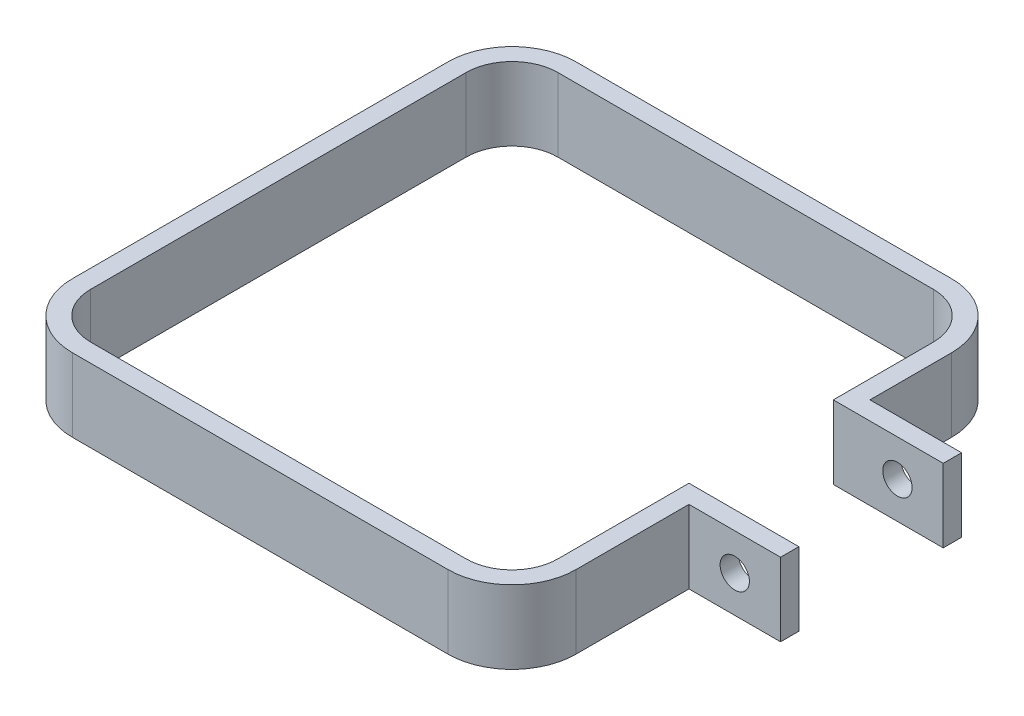
ISO-10303-21;
HEADER;
FILE_DESCRIPTION(('STEP AP214'),'2;1');
FILE_NAME('part.step','',(''),(''),'','','');
FILE_SCHEMA(('AUTOMOTIVE_DESIGN { 1 0 10303 214 1 1 1 1 }'));
ENDSEC;
DATA;
#1=APPLICATION_CONTEXT('core data for automotive mechanical design processes');
#2=APPLICATION_PROTOCOL_DEFINITION('international standard','automotive_design',2000,#1);
#3=PRODUCT_CONTEXT('',#1,'mechanical');
#4=PRODUCT('Part','Part','',(#3));
#5=PRODUCT_RELATED_PRODUCT_CATEGORY('part','',(#4));
#6=PRODUCT_DEFINITION_FORMATION('','',#4);
#7=PRODUCT_DEFINITION_CONTEXT('part definition',#1,'design');
#8=PRODUCT_DEFINITION('design','',#6,#7);
#9=PRODUCT_DEFINITION_SHAPE('','',#8);
#10=(LENGTH_UNIT() NAMED_UNIT(*) SI_UNIT(.MILLI.,.METRE.));
#11=(NAMED_UNIT(*) PLANE_ANGLE_UNIT() SI_UNIT($,.RADIAN.));
#12=(NAMED_UNIT(*) SI_UNIT($,.STERADIAN.) SOLID_ANGLE_UNIT());
#13=UNCERTAINTY_MEASURE_WITH_UNIT(LENGTH_MEASURE(1.E-05),#10,'distance_accuracy_value','');
#14=(GEOMETRIC_REPRESENTATION_CONTEXT(3) GLOBAL_UNCERTAINTY_ASSIGNED_CONTEXT((#13)) GLOBAL_UNIT_ASSIGNED_CONTEXT((#10,
#11,#12)) REPRESENTATION_CONTEXT('',''));
#15=CARTESIAN_POINT('',(0.,0.,0.));
#16=DIRECTION('',(0.,0.,1.));
#17=DIRECTION('',(1.,0.,0.));
#18=AXIS2_PLACEMENT_3D('',#15,#16,#17);
#19=CARTESIAN_POINT('',(20.5,8.,20.5));
#20=DIRECTION('',(0.,-1.,0.));
#21=DIRECTION('',(0.,0.,-1.));
#22=AXIS2_PLACEMENT_3D('',#19,#20,#21);
#23=CYLINDRICAL_SURFACE('',#22,5.);
#24=CARTESIAN_POINT('',(20.5,0.,20.5));
#25=DIRECTION('',(0.,-1.,0.));
#26=DIRECTION('',(0.,0.,1.));
#27=AXIS2_PLACEMENT_3D('',#24,#25,#26);
#28=CIRCLE('',#27,5.);
#29=CARTESIAN_POINT('',(25.5,0.,20.5));
#30=VERTEX_POINT('',#29);
#31=CARTESIAN_POINT('',(20.5,0.,25.5));
#32=VERTEX_POINT('',#31);
#33=EDGE_CURVE('E237',#30,#32,#28,.T.);
#34=ORIENTED_EDGE('',*,*,#33,.T.);
#35=DIRECTION('',(0.,-1.,0.));
#36=VECTOR('',#35,1.);
#37=CARTESIAN_POINT('',(20.5,8.,25.5));
#38=LINE('',#37,#36);
#39=CARTESIAN_POINT('',(20.5,8.,25.5));
#40=VERTEX_POINT('',#39);
#41=EDGE_CURVE('E11',#40,#32,#38,.T.);
#42=ORIENTED_EDGE('',*,*,#41,.F.);
#43=CARTESIAN_POINT('',(20.5,8.,20.5));
#44=DIRECTION('',(0.,-1.,0.));
#45=DIRECTION('',(0.,0.,1.));
#46=AXIS2_PLACEMENT_3D('',#43,#44,#45);
#47=CIRCLE('',#46,5.);
#48=CARTESIAN_POINT('',(25.5,8.,20.5));
#49=VERTEX_POINT('',#48);
#50=EDGE_CURVE('E309',#49,#40,#47,.T.);
#51=ORIENTED_EDGE('',*,*,#50,.F.);
#52=DIRECTION('',(0.,-1.,0.));
#53=VECTOR('',#52,1.);
#54=CARTESIAN_POINT('',(25.5,8.,20.5));
#55=LINE('',#54,#53);
#56=EDGE_CURVE('E233',#49,#30,#55,.T.);
#57=ORIENTED_EDGE('',*,*,#56,.T.);
#58=EDGE_LOOP('',(#34,#42,#51,#57));
#59=FACE_BOUND('',#58,.T.);
#60=ADVANCED_FACE('F39',(#59),#23,.F.);
#61=CARTESIAN_POINT('',(-20.5,8.,25.5));
#62=DIRECTION('',(0.,0.,1.));
#63=DIRECTION('',(1.,0.,0.));
#64=AXIS2_PLACEMENT_3D('',#61,#62,#63);
#65=PLANE('',#64);
#66=DIRECTION('',(-1.,0.,0.));
#67=VECTOR('',#66,1.);
#68=CARTESIAN_POINT('',(-20.5,0.,25.5));
#69=LINE('',#68,#67);
#70=CARTESIAN_POINT('',(-20.5,0.,25.5));
#71=VERTEX_POINT('',#70);
#72=EDGE_CURVE('E241',#32,#71,#69,.T.);
#73=ORIENTED_EDGE('',*,*,#72,.T.);
#74=DIRECTION('',(0.,-1.,0.));
#75=VECTOR('',#74,1.);
#76=CARTESIAN_POINT('',(-20.5,8.,25.5));
#77=LINE('',#76,#75);
#78=CARTESIAN_POINT('',(-20.5,8.,25.5));
#79=VERTEX_POINT('',#78);
#80=EDGE_CURVE('E49',#79,#71,#77,.T.);
#81=ORIENTED_EDGE('',*,*,#80,.F.);
#82=DIRECTION('',(-1.,0.,0.));
#83=VECTOR('',#82,1.);
#84=CARTESIAN_POINT('',(-20.5,8.,25.5));
#85=LINE('',#84,#83);
#86=EDGE_CURVE('E147',#40,#79,#85,.T.);
#87=ORIENTED_EDGE('',*,*,#86,.F.);
#88=ORIENTED_EDGE('',*,*,#41,.T.);
#89=EDGE_LOOP('',(#73,#81,#87,#88));
#90=FACE_BOUND('',#89,.T.);
#91=ADVANCED_FACE('F489',(#90),#65,.F.);
#92=CARTESIAN_POINT('',(-20.5,8.,20.5));
#93=DIRECTION('',(0.,-1.,0.));
#94=DIRECTION('',(0.,0.,-1.));
#95=AXIS2_PLACEMENT_3D('',#92,#93,#94);
#96=CYLINDRICAL_SURFACE('',#95,5.);
#97=CARTESIAN_POINT('',(-20.5,0.,20.5));
#98=DIRECTION('',(0.,-1.,0.));
#99=DIRECTION('',(0.,0.,-1.));
#100=AXIS2_PLACEMENT_3D('',#97,#98,#99);
#101=CIRCLE('',#100,5.);
#102=CARTESIAN_POINT('',(-25.5,0.,20.5));
#103=VERTEX_POINT('',#102);
#104=EDGE_CURVE('E245',#71,#103,#101,.T.);
#105=ORIENTED_EDGE('',*,*,#104,.T.);
#106=DIRECTION('',(0.,-1.,0.));
#107=VECTOR('',#106,1.);
#108=CARTESIAN_POINT('',(-25.5,8.,20.5));
#109=LINE('',#108,#107);
#110=CARTESIAN_POINT('',(-25.5,8.,20.5));
#111=VERTEX_POINT('',#110);
#112=EDGE_CURVE('E384',#111,#103,#109,.T.);
#113=ORIENTED_EDGE('',*,*,#112,.F.);
#114=CARTESIAN_POINT('',(-20.5,8.,20.5));
#115=DIRECTION('',(0.,-1.,0.));
#116=DIRECTION('',(0.,0.,-1.));
#117=AXIS2_PLACEMENT_3D('',#114,#115,#116);
#118=CIRCLE('',#117,5.);
#119=EDGE_CURVE('E395',#79,#111,#118,.T.);
#120=ORIENTED_EDGE('',*,*,#119,.F.);
#121=ORIENTED_EDGE('',*,*,#80,.T.);
#122=EDGE_LOOP('',(#105,#113,#120,#121));
#123=FACE_BOUND('',#122,.T.);
#124=ADVANCED_FACE('F393',(#123),#96,.F.);
#125=CARTESIAN_POINT('',(-25.5,8.,-20.5));
#126=DIRECTION('',(-1.,0.,0.));
#127=DIRECTION('',(0.,0.,1.));
#128=AXIS2_PLACEMENT_3D('',#125,#126,#127);
#129=PLANE('',#128);
#130=DIRECTION('',(0.,0.,-1.));
#131=VECTOR('',#130,1.);
#132=CARTESIAN_POINT('',(-25.5,0.,-20.5));
#133=LINE('',#132,#131);
#134=CARTESIAN_POINT('',(-25.5,0.,-20.5));
#135=VERTEX_POINT('',#134);
#136=EDGE_CURVE('E248',#103,#135,#133,.T.);
#137=ORIENTED_EDGE('',*,*,#136,.T.);
#138=DIRECTION('',(0.,-1.,0.));
#139=VECTOR('',#138,1.);
#140=CARTESIAN_POINT('',(-25.5,8.,-20.5));
#141=LINE('',#140,#139);
#142=CARTESIAN_POINT('',(-25.5,8.,-20.5));
#143=VERTEX_POINT('',#142);
#144=EDGE_CURVE('E380',#143,#135,#141,.T.);
#145=ORIENTED_EDGE('',*,*,#144,.F.);
#146=DIRECTION('',(0.,0.,-1.));
#147=VECTOR('',#146,1.);
#148=CARTESIAN_POINT('',(-25.5,8.,-20.5));
#149=LINE('',#148,#147);
#150=EDGE_CURVE('E414',#111,#143,#149,.T.);
#151=ORIENTED_EDGE('',*,*,#150,.F.);
#152=ORIENTED_EDGE('',*,*,#112,.T.);
#153=EDGE_LOOP('',(#137,#145,#151,#152));
#154=FACE_BOUND('',#153,.T.);
#155=ADVANCED_FACE('F404',(#154),#129,.F.);
#156=CARTESIAN_POINT('',(-20.5,8.,-20.5));
#157=DIRECTION('',(0.,-1.,0.));
#158=DIRECTION('',(0.,0.,-1.));
#159=AXIS2_PLACEMENT_3D('',#156,#157,#158);
#160=CYLINDRICAL_SURFACE('',#159,5.);
#161=CARTESIAN_POINT('',(-20.5,0.,-20.5));
#162=DIRECTION('',(0.,-1.,0.));
#163=DIRECTION('',(0.,0.,1.));
#164=AXIS2_PLACEMENT_3D('',#161,#162,#163);
#165=CIRCLE('',#164,5.);
#166=CARTESIAN_POINT('',(-20.5,0.,-25.5));
#167=VERTEX_POINT('',#166);
#168=EDGE_CURVE('E251',#135,#167,#165,.T.);
#169=ORIENTED_EDGE('',*,*,#168,.T.);
#170=DIRECTION('',(0.,-1.,0.));
#171=VECTOR('',#170,1.);
#172=CARTESIAN_POINT('',(-20.5,8.,-25.5));
#173=LINE('',#172,#171);
#174=CARTESIAN_POINT('',(-20.5,8.,-25.5));
#175=VERTEX_POINT('',#174);
#176=EDGE_CURVE('E376',#175,#167,#173,.T.);
#177=ORIENTED_EDGE('',*,*,#176,.F.);
#178=CARTESIAN_POINT('',(-20.5,8.,-20.5));
#179=DIRECTION('',(0.,-1.,0.));
#180=DIRECTION('',(0.,0.,1.));
#181=AXIS2_PLACEMENT_3D('',#178,#179,#180);
#182=CIRCLE('',#181,5.);
#183=EDGE_CURVE('E410',#143,#175,#182,.T.);
#184=ORIENTED_EDGE('',*,*,#183,.F.);
#185=ORIENTED_EDGE('',*,*,#144,.T.);
#186=EDGE_LOOP('',(#169,#177,#184,#185));
#187=FACE_BOUND('',#186,.T.);
#188=ADVANCED_FACE('F408',(#187),#160,.F.);
#189=CARTESIAN_POINT('',(-20.5,8.,-25.5));
#190=DIRECTION('',(0.,0.,-1.));
#191=DIRECTION('',(-1.,0.,0.));
#192=AXIS2_PLACEMENT_3D('',#189,#190,#191);
#193=PLANE('',#192);
#194=DIRECTION('',(1.,0.,0.));
#195=VECTOR('',#194,1.);
#196=CARTESIAN_POINT('',(-20.5,0.,-25.5));
#197=LINE('',#196,#195);
#198=CARTESIAN_POINT('',(20.5,0.,-25.5));
#199=VERTEX_POINT('',#198);
#200=EDGE_CURVE('E254',#167,#199,#197,.T.);
#201=ORIENTED_EDGE('',*,*,#200,.T.);
#202=DIRECTION('',(0.,-1.,0.));
#203=VECTOR('',#202,1.);
#204=CARTESIAN_POINT('',(20.5,8.,-25.5));
#205=LINE('',#204,#203);
#206=CARTESIAN_POINT('',(20.5,8.,-25.5));
#207=VERTEX_POINT('',#206);
#208=EDGE_CURVE('E372',#207,#199,#205,.T.);
#209=ORIENTED_EDGE('',*,*,#208,.F.);
#210=DIRECTION('',(1.,0.,0.));
#211=VECTOR('',#210,1.);
#212=CARTESIAN_POINT('',(-20.5,8.,-25.5));
#213=LINE('',#212,#211);
#214=EDGE_CURVE('E413',#175,#207,#213,.T.);
#215=ORIENTED_EDGE('',*,*,#214,.F.);
#216=ORIENTED_EDGE('',*,*,#176,.T.);
#217=EDGE_LOOP('',(#201,#209,#215,#216));
#218=FACE_BOUND('',#217,.T.);
#219=ADVANCED_FACE('F502',(#218),#193,.F.);
#220=CARTESIAN_POINT('',(20.5,8.,-20.5));
#221=DIRECTION('',(0.,-1.,0.));
#222=DIRECTION('',(0.,0.,-1.));
#223=AXIS2_PLACEMENT_3D('',#220,#221,#222);
#224=CYLINDRICAL_SURFACE('',#223,5.);
#225=CARTESIAN_POINT('',(20.5,0.,-20.5));
#226=DIRECTION('',(0.,-1.,0.));
#227=DIRECTION('',(0.,0.,1.));
#228=AXIS2_PLACEMENT_3D('',#225,#226,#227);
#229=CIRCLE('',#228,5.);
#230=CARTESIAN_POINT('',(25.5,0.,-20.5));
#231=VERTEX_POINT('',#230);
#232=EDGE_CURVE('E257',#199,#231,#229,.T.);
#233=ORIENTED_EDGE('',*,*,#232,.T.);
#234=DIRECTION('',(0.,-1.,0.));
#235=VECTOR('',#234,1.);
#236=CARTESIAN_POINT('',(25.5,8.,-20.5));
#237=LINE('',#236,#235);
#238=CARTESIAN_POINT('',(25.5,8.,-20.5));
#239=VERTEX_POINT('',#238);
#240=EDGE_CURVE('E368',#239,#231,#237,.T.);
#241=ORIENTED_EDGE('',*,*,#240,.F.);
#242=CARTESIAN_POINT('',(20.5,8.,-20.5));
#243=DIRECTION('',(0.,-1.,0.));
#244=DIRECTION('',(0.,0.,1.));
#245=AXIS2_PLACEMENT_3D('',#242,#243,#244);
#246=CIRCLE('',#245,5.);
#247=EDGE_CURVE('E418',#207,#239,#246,.T.);
#248=ORIENTED_EDGE('',*,*,#247,.F.);
#249=ORIENTED_EDGE('',*,*,#208,.T.);
#250=EDGE_LOOP('',(#233,#241,#248,#249));
#251=FACE_BOUND('',#250,.T.);
#252=ADVANCED_FACE('F505',(#251),#224,.F.);
#253=CARTESIAN_POINT('',(25.5,8.,-20.5));
#254=DIRECTION('',(1.,0.,0.));
#255=DIRECTION('',(0.,0.,-1.));
#256=AXIS2_PLACEMENT_3D('',#253,#254,#255);
#257=PLANE('',#256);
#258=DIRECTION('',(0.,0.,1.));
#259=VECTOR('',#258,1.);
#260=CARTESIAN_POINT('',(25.5,0.,-20.5));
#261=LINE('',#260,#259);
#262=CARTESIAN_POINT('',(25.5,0.,-9.5841835));
#263=VERTEX_POINT('',#262);
#264=EDGE_CURVE('E260',#231,#263,#261,.T.);
#265=ORIENTED_EDGE('',*,*,#264,.T.);
#266=DIRECTION('',(0.,-1.,0.));
#267=VECTOR('',#266,1.);
#268=CARTESIAN_POINT('',(25.5,8.,-9.5841835));
#269=LINE('',#268,#267);
#270=CARTESIAN_POINT('',(25.5,8.,-9.5841835));
#271=VERTEX_POINT('',#270);
#272=EDGE_CURVE('E364',#271,#263,#269,.T.);
#273=ORIENTED_EDGE('',*,*,#272,.F.);
#274=DIRECTION('',(0.,0.,1.));
#275=VECTOR('',#274,1.);
#276=CARTESIAN_POINT('',(25.5,8.,-20.5));
#277=LINE('',#276,#275);
#278=EDGE_CURVE('E425',#239,#271,#277,.T.);
#279=ORIENTED_EDGE('',*,*,#278,.F.);
#280=ORIENTED_EDGE('',*,*,#240,.T.);
#281=EDGE_LOOP('',(#265,#273,#279,#280));
#282=FACE_BOUND('',#281,.T.);
#283=ADVANCED_FACE('F509',(#282),#257,.F.);
#284=CARTESIAN_POINT('',(37.5,8.,-9.5841835));
#285=DIRECTION('',(0.,0.,-1.));
#286=DIRECTION('',(-1.,0.,0.));
#287=AXIS2_PLACEMENT_3D('',#284,#285,#286);
#288=PLANE('',#287);
#289=CARTESIAN_POINT('',(32.5,4.,-9.5841835));
#290=DIRECTION('',(0.,0.,-1.));
#291=DIRECTION('',(-1.,0.,0.));
#292=AXIS2_PLACEMENT_3D('',#289,#290,#291);
#293=CIRCLE('',#292,1.6);
#294=CARTESIAN_POINT('',(30.9,4.,-9.5841835));
#295=VERTEX_POINT('',#294);
#296=EDGE_CURVE('E242',#295,#295,#293,.T.);
#297=ORIENTED_EDGE('',*,*,#296,.T.);
#298=EDGE_LOOP('',(#297));
#299=FACE_BOUND('',#298,.T.);
#300=DIRECTION('',(1.,0.,0.));
#301=VECTOR('',#300,1.);
#302=CARTESIAN_POINT('',(37.5,0.,-9.5841835));
#303=LINE('',#302,#301);
#304=CARTESIAN_POINT('',(37.5,0.,-9.5841835));
#305=VERTEX_POINT('',#304);
#306=EDGE_CURVE('E264',#263,#305,#303,.T.);
#307=ORIENTED_EDGE('',*,*,#306,.T.);
#308=DIRECTION('',(0.,-1.,0.));
#309=VECTOR('',#308,1.);
#310=CARTESIAN_POINT('',(37.5,8.,-9.5841835));
#311=LINE('',#310,#309);
#312=CARTESIAN_POINT('',(37.5,8.,-9.5841835));
#313=VERTEX_POINT('',#312);
#314=EDGE_CURVE('E360',#313,#305,#311,.T.);
#315=ORIENTED_EDGE('',*,*,#314,.F.);
#316=DIRECTION('',(1.,0.,0.));
#317=VECTOR('',#316,1.);
#318=CARTESIAN_POINT('',(27.5,8.,-9.5841835));
#319=LINE('',#318,#317);
#320=EDGE_CURVE('E428',#271,#313,#319,.T.);
#321=ORIENTED_EDGE('',*,*,#320,.F.);
#322=ORIENTED_EDGE('',*,*,#272,.T.);
#323=EDGE_LOOP('',(#307,#315,#321,#322));
#324=FACE_BOUND('',#323,.T.);
#325=ADVANCED_FACE('F513',(#299,#324),#288,.F.);
#326=CARTESIAN_POINT('',(37.5,8.,-11.5841835));
#327=DIRECTION('',(-1.,0.,0.));
#328=DIRECTION('',(0.,0.,1.));
#329=AXIS2_PLACEMENT_3D('',#326,#327,#328);
#330=PLANE('',#329);
#331=DIRECTION('',(0.,0.,-1.));
#332=VECTOR('',#331,1.);
#333=CARTESIAN_POINT('',(37.5,0.,-11.5841835));
#334=LINE('',#333,#332);
#335=CARTESIAN_POINT('',(37.5,0.,-11.5841835));
#336=VERTEX_POINT('',#335);
#337=EDGE_CURVE('E267',#305,#336,#334,.T.);
#338=ORIENTED_EDGE('',*,*,#337,.T.);
#339=DIRECTION('',(0.,-1.,0.));
#340=VECTOR('',#339,1.);
#341=CARTESIAN_POINT('',(37.5,8.,-11.5841835));
#342=LINE('',#341,#340);
#343=CARTESIAN_POINT('',(37.5,8.,-11.5841835));
#344=VERTEX_POINT('',#343);
#345=EDGE_CURVE('E356',#344,#336,#342,.T.);
#346=ORIENTED_EDGE('',*,*,#345,.F.);
#347=DIRECTION('',(0.,0.,-1.));
#348=VECTOR('',#347,1.);
#349=CARTESIAN_POINT('',(37.5,8.,-11.5841835));
#350=LINE('',#349,#348);
#351=EDGE_CURVE('E431',#313,#344,#350,.T.);
#352=ORIENTED_EDGE('',*,*,#351,.F.);
#353=ORIENTED_EDGE('',*,*,#314,.T.);
#354=EDGE_LOOP('',(#338,#346,#352,#353));
#355=FACE_BOUND('',#354,.T.);
#356=ADVANCED_FACE('F517',(#355),#330,.F.);
#357=CARTESIAN_POINT('',(27.5,8.,-11.5841835));
#358=DIRECTION('',(0.,0.,1.));
#359=DIRECTION('',(1.,0.,0.));
#360=AXIS2_PLACEMENT_3D('',#357,#358,#359);
#361=PLANE('',#360);
#362=CARTESIAN_POINT('',(32.5,4.,-11.5841835));
#363=DIRECTION('',(0.,0.,-1.));
#364=DIRECTION('',(-1.,0.,0.));
#365=AXIS2_PLACEMENT_3D('',#362,#363,#364);
#366=CIRCLE('',#365,1.6);
#367=CARTESIAN_POINT('',(30.9,4.,-11.5841835));
#368=VERTEX_POINT('',#367);
#369=EDGE_CURVE('E743',#368,#368,#366,.T.);
#370=ORIENTED_EDGE('',*,*,#369,.F.);
#371=EDGE_LOOP('',(#370));
#372=FACE_BOUND('',#371,.T.);
#373=DIRECTION('',(-1.,0.,0.));
#374=VECTOR('',#373,1.);
#375=CARTESIAN_POINT('',(27.5,0.,-11.5841835));
#376=LINE('',#375,#374);
#377=CARTESIAN_POINT('',(27.5,0.,-11.5841835));
#378=VERTEX_POINT('',#377);
#379=EDGE_CURVE('E270',#336,#378,#376,.T.);
#380=ORIENTED_EDGE('',*,*,#379,.T.);
#381=DIRECTION('',(0.,-1.,0.));
#382=VECTOR('',#381,1.);
#383=CARTESIAN_POINT('',(27.5,8.,-11.5841835));
#384=LINE('',#383,#382);
#385=CARTESIAN_POINT('',(27.5,8.,-11.5841835));
#386=VERTEX_POINT('',#385);
#387=EDGE_CURVE('E352',#386,#378,#384,.T.);
#388=ORIENTED_EDGE('',*,*,#387,.F.);
#389=DIRECTION('',(-1.,0.,0.));
#390=VECTOR('',#389,1.);
#391=CARTESIAN_POINT('',(27.5,8.,-11.5841835));
#392=LINE('',#391,#390);
#393=EDGE_CURVE('E434',#344,#386,#392,.T.);
#394=ORIENTED_EDGE('',*,*,#393,.F.);
#395=ORIENTED_EDGE('',*,*,#345,.T.);
#396=EDGE_LOOP('',(#380,#388,#394,#395));
#397=FACE_BOUND('',#396,.T.);
#398=ADVANCED_FACE('F521',(#372,#397),#361,.F.);
#399=CARTESIAN_POINT('',(27.5,8.,-20.5));
#400=DIRECTION('',(-1.,0.,0.));
#401=DIRECTION('',(0.,0.,1.));
#402=AXIS2_PLACEMENT_3D('',#399,#400,#401);
#403=PLANE('',#402);
#404=DIRECTION('',(0.,0.,-1.));
#405=VECTOR('',#404,1.);
#406=CARTESIAN_POINT('',(27.5,0.,-20.5));
#407=LINE('',#406,#405);
#408=CARTESIAN_POINT('',(27.5,0.,-20.5));
#409=VERTEX_POINT('',#408);
#410=EDGE_CURVE('E273',#378,#409,#407,.T.);
#411=ORIENTED_EDGE('',*,*,#410,.T.);
#412=DIRECTION('',(0.,-1.,0.));
#413=VECTOR('',#412,1.);
#414=CARTESIAN_POINT('',(27.5,8.,-20.5));
#415=LINE('',#414,#413);
#416=CARTESIAN_POINT('',(27.5,8.,-20.5));
#417=VERTEX_POINT('',#416);
#418=EDGE_CURVE('E348',#417,#409,#415,.T.);
#419=ORIENTED_EDGE('',*,*,#418,.F.);
#420=DIRECTION('',(0.,0.,-1.));
#421=VECTOR('',#420,1.);
#422=CARTESIAN_POINT('',(27.5,8.,-20.5));
#423=LINE('',#422,#421);
#424=EDGE_CURVE('E437',#386,#417,#423,.T.);
#425=ORIENTED_EDGE('',*,*,#424,.F.);
#426=ORIENTED_EDGE('',*,*,#387,.T.);
#427=EDGE_LOOP('',(#411,#419,#425,#426));
#428=FACE_BOUND('',#427,.T.);
#429=ADVANCED_FACE('F525',(#428),#403,.F.);
#430=CARTESIAN_POINT('',(20.5,8.,-20.5));
#431=DIRECTION('',(0.,-1.,0.));
#432=DIRECTION('',(0.,0.,-1.));
#433=AXIS2_PLACEMENT_3D('',#430,#431,#432);
#434=CYLINDRICAL_SURFACE('',#433,7.);
#435=CARTESIAN_POINT('',(20.5,0.,-20.5));
#436=DIRECTION('',(0.,1.,0.));
#437=DIRECTION('',(0.,0.,1.));
#438=AXIS2_PLACEMENT_3D('',#435,#436,#437);
#439=CIRCLE('',#438,7.);
#440=CARTESIAN_POINT('',(20.5,0.,-27.5));
#441=VERTEX_POINT('',#440);
#442=EDGE_CURVE('E276',#409,#441,#439,.T.);
#443=ORIENTED_EDGE('',*,*,#442,.T.);
#444=DIRECTION('',(0.,-1.,0.));
#445=VECTOR('',#444,1.);
#446=CARTESIAN_POINT('',(20.5,8.,-27.5));
#447=LINE('',#446,#445);
#448=CARTESIAN_POINT('',(20.5,8.,-27.5));
#449=VERTEX_POINT('',#448);
#450=EDGE_CURVE('E344',#449,#441,#447,.T.);
#451=ORIENTED_EDGE('',*,*,#450,.F.);
#452=CARTESIAN_POINT('',(20.5,8.,-20.5));
#453=DIRECTION('',(0.,1.,0.));
#454=DIRECTION('',(0.,0.,1.));
#455=AXIS2_PLACEMENT_3D('',#452,#453,#454);
#456=CIRCLE('',#455,7.);
#457=EDGE_CURVE('E440',#417,#449,#456,.T.);
#458=ORIENTED_EDGE('',*,*,#457,.F.);
#459=ORIENTED_EDGE('',*,*,#418,.T.);
#460=EDGE_LOOP('',(#443,#451,#458,#459));
#461=FACE_BOUND('',#460,.T.);
#462=ADVANCED_FACE('F529',(#461),#434,.T.);
#463=CARTESIAN_POINT('',(-20.5,8.,-27.5));
#464=DIRECTION('',(0.,0.,1.));
#465=DIRECTION('',(1.,0.,0.));
#466=AXIS2_PLACEMENT_3D('',#463,#464,#465);
#467=PLANE('',#466);
#468=DIRECTION('',(-1.,0.,0.));
#469=VECTOR('',#468,1.);
#470=CARTESIAN_POINT('',(-20.5,0.,-27.5));
#471=LINE('',#470,#469);
#472=CARTESIAN_POINT('',(-20.5,0.,-27.5));
#473=VERTEX_POINT('',#472);
#474=EDGE_CURVE('E279',#441,#473,#471,.T.);
#475=ORIENTED_EDGE('',*,*,#474,.T.);
#476=DIRECTION('',(0.,-1.,0.));
#477=VECTOR('',#476,1.);
#478=CARTESIAN_POINT('',(-20.5,8.,-27.5));
#479=LINE('',#478,#477);
#480=CARTESIAN_POINT('',(-20.5,8.,-27.5));
#481=VERTEX_POINT('',#480);
#482=EDGE_CURVE('E340',#481,#473,#479,.T.);
#483=ORIENTED_EDGE('',*,*,#482,.F.);
#484=DIRECTION('',(-1.,0.,0.));
#485=VECTOR('',#484,1.);
#486=CARTESIAN_POINT('',(-20.5,8.,-27.5));
#487=LINE('',#486,#485);
#488=EDGE_CURVE('E443',#449,#481,#487,.T.);
#489=ORIENTED_EDGE('',*,*,#488,.F.);
#490=ORIENTED_EDGE('',*,*,#450,.T.);
#491=EDGE_LOOP('',(#475,#483,#489,#490));
#492=FACE_BOUND('',#491,.T.);
#493=ADVANCED_FACE('F533',(#492),#467,.F.);
#494=CARTESIAN_POINT('',(-20.5,8.,-20.5));
#495=DIRECTION('',(0.,-1.,0.));
#496=DIRECTION('',(0.,0.,-1.));
#497=AXIS2_PLACEMENT_3D('',#494,#495,#496);
#498=CYLINDRICAL_SURFACE('',#497,7.);
#499=CARTESIAN_POINT('',(-20.5,0.,-20.5));
#500=DIRECTION('',(0.,1.,0.));
#501=DIRECTION('',(0.,0.,1.));
#502=AXIS2_PLACEMENT_3D('',#499,#500,#501);
#503=CIRCLE('',#502,7.);
#504=CARTESIAN_POINT('',(-27.5,0.,-20.5));
#505=VERTEX_POINT('',#504);
#506=EDGE_CURVE('E282',#473,#505,#503,.T.);
#507=ORIENTED_EDGE('',*,*,#506,.T.);
#508=DIRECTION('',(0.,-1.,0.));
#509=VECTOR('',#508,1.);
#510=CARTESIAN_POINT('',(-27.5,8.,-20.5));
#511=LINE('',#510,#509);
#512=CARTESIAN_POINT('',(-27.5,8.,-20.5));
#513=VERTEX_POINT('',#512);
#514=EDGE_CURVE('E336',#513,#505,#511,.T.);
#515=ORIENTED_EDGE('',*,*,#514,.F.);
#516=CARTESIAN_POINT('',(-20.5,8.,-20.5));
#517=DIRECTION('',(0.,1.,0.));
#518=DIRECTION('',(0.,0.,1.));
#519=AXIS2_PLACEMENT_3D('',#516,#517,#518);
#520=CIRCLE('',#519,7.);
#521=EDGE_CURVE('E446',#481,#513,#520,.T.);
#522=ORIENTED_EDGE('',*,*,#521,.F.);
#523=ORIENTED_EDGE('',*,*,#482,.T.);
#524=EDGE_LOOP('',(#507,#515,#522,#523));
#525=FACE_BOUND('',#524,.T.);
#526=ADVANCED_FACE('F537',(#525),#498,.T.);
#527=CARTESIAN_POINT('',(-27.5,8.,-20.5));
#528=DIRECTION('',(1.,0.,0.));
#529=DIRECTION('',(0.,0.,-1.));
#530=AXIS2_PLACEMENT_3D('',#527,#528,#529);
#531=PLANE('',#530);
#532=DIRECTION('',(0.,0.,1.));
#533=VECTOR('',#532,1.);
#534=CARTESIAN_POINT('',(-27.5,0.,-20.5));
#535=LINE('',#534,#533);
#536=CARTESIAN_POINT('',(-27.5,0.,20.4999999999999));
#537=VERTEX_POINT('',#536);
#538=EDGE_CURVE('E285',#505,#537,#535,.T.);
#539=ORIENTED_EDGE('',*,*,#538,.T.);
#540=DIRECTION('',(0.,-1.,0.));
#541=VECTOR('',#540,1.);
#542=CARTESIAN_POINT('',(-27.5,8.,20.4999999999999));
#543=LINE('',#542,#541);
#544=CARTESIAN_POINT('',(-27.5,8.,20.4999999999999));
#545=VERTEX_POINT('',#544);
#546=EDGE_CURVE('E332',#545,#537,#543,.T.);
#547=ORIENTED_EDGE('',*,*,#546,.F.);
#548=DIRECTION('',(0.,0.,1.));
#549=VECTOR('',#548,1.);
#550=CARTESIAN_POINT('',(-27.5,8.,-20.5));
#551=LINE('',#550,#549);
#552=EDGE_CURVE('E449',#513,#545,#551,.T.);
#553=ORIENTED_EDGE('',*,*,#552,.F.);
#554=ORIENTED_EDGE('',*,*,#514,.T.);
#555=EDGE_LOOP('',(#539,#547,#553,#554));
#556=FACE_BOUND('',#555,.T.);
#557=ADVANCED_FACE('F541',(#556),#531,.F.);
#558=CARTESIAN_POINT('',(-20.5,8.,20.5));
#559=DIRECTION('',(0.,-1.,0.));
#560=DIRECTION('',(0.,0.,-1.));
#561=AXIS2_PLACEMENT_3D('',#558,#559,#560);
#562=CYLINDRICAL_SURFACE('',#561,7.);
#563=CARTESIAN_POINT('',(-20.5,0.,20.5));
#564=DIRECTION('',(0.,1.,0.));
#565=DIRECTION('',(0.,0.,-1.));
#566=AXIS2_PLACEMENT_3D('',#563,#564,#565);
#567=CIRCLE('',#566,7.);
#568=CARTESIAN_POINT('',(-20.5,0.,27.5));
#569=VERTEX_POINT('',#568);
#570=EDGE_CURVE('E288',#537,#569,#567,.T.);
#571=ORIENTED_EDGE('',*,*,#570,.T.);
#572=DIRECTION('',(0.,-1.,0.));
#573=VECTOR('',#572,1.);
#574=CARTESIAN_POINT('',(-20.5,8.,27.5));
#575=LINE('',#574,#573);
#576=CARTESIAN_POINT('',(-20.5,8.,27.5));
#577=VERTEX_POINT('',#576);
#578=EDGE_CURVE('E328',#577,#569,#575,.T.);
#579=ORIENTED_EDGE('',*,*,#578,.F.);
#580=CARTESIAN_POINT('',(-20.5,8.,20.5));
#581=DIRECTION('',(0.,1.,0.));
#582=DIRECTION('',(0.,0.,-1.));
#583=AXIS2_PLACEMENT_3D('',#580,#581,#582);
#584=CIRCLE('',#583,7.);
#585=EDGE_CURVE('E452',#545,#577,#584,.T.);
#586=ORIENTED_EDGE('',*,*,#585,.F.);
#587=ORIENTED_EDGE('',*,*,#546,.T.);
#588=EDGE_LOOP('',(#571,#579,#586,#587));
#589=FACE_BOUND('',#588,.T.);
#590=ADVANCED_FACE('F545',(#589),#562,.T.);
#591=CARTESIAN_POINT('',(-20.5,8.,27.5));
#592=DIRECTION('',(0.,0.,-1.));
#593=DIRECTION('',(-1.,0.,0.));
#594=AXIS2_PLACEMENT_3D('',#591,#592,#593);
#595=PLANE('',#594);
#596=DIRECTION('',(1.,0.,0.));
#597=VECTOR('',#596,1.);
#598=CARTESIAN_POINT('',(-20.5,0.,27.5));
#599=LINE('',#598,#597);
#600=CARTESIAN_POINT('',(20.4999999999999,0.,27.5));
#601=VERTEX_POINT('',#600);
#602=EDGE_CURVE('E291',#569,#601,#599,.T.);
#603=ORIENTED_EDGE('',*,*,#602,.T.);
#604=DIRECTION('',(0.,-1.,0.));
#605=VECTOR('',#604,1.);
#606=CARTESIAN_POINT('',(20.4999999999999,8.,27.5));
#607=LINE('',#606,#605);
#608=CARTESIAN_POINT('',(20.4999999999999,8.,27.5));
#609=VERTEX_POINT('',#608);
#610=EDGE_CURVE('E324',#609,#601,#607,.T.);
#611=ORIENTED_EDGE('',*,*,#610,.F.);
#612=DIRECTION('',(1.,0.,0.));
#613=VECTOR('',#612,1.);
#614=CARTESIAN_POINT('',(-20.5,8.,27.5));
#615=LINE('',#614,#613);
#616=EDGE_CURVE('E455',#577,#609,#615,.T.);
#617=ORIENTED_EDGE('',*,*,#616,.F.);
#618=ORIENTED_EDGE('',*,*,#578,.T.);
#619=EDGE_LOOP('',(#603,#611,#617,#618));
#620=FACE_BOUND('',#619,.T.);
#621=ADVANCED_FACE('F549',(#620),#595,.F.);
#622=CARTESIAN_POINT('',(20.5,8.,20.5));
#623=DIRECTION('',(0.,-1.,0.));
#624=DIRECTION('',(0.,0.,-1.));
#625=AXIS2_PLACEMENT_3D('',#622,#623,#624);
#626=CYLINDRICAL_SURFACE('',#625,7.);
#627=CARTESIAN_POINT('',(20.5,0.,20.5));
#628=DIRECTION('',(0.,1.,0.));
#629=DIRECTION('',(0.,0.,1.));
#630=AXIS2_PLACEMENT_3D('',#627,#628,#629);
#631=CIRCLE('',#630,7.);
#632=CARTESIAN_POINT('',(27.5,0.,20.5));
#633=VERTEX_POINT('',#632);
#634=EDGE_CURVE('E294',#601,#633,#631,.T.);
#635=ORIENTED_EDGE('',*,*,#634,.T.);
#636=DIRECTION('',(0.,-1.,0.));
#637=VECTOR('',#636,1.);
#638=CARTESIAN_POINT('',(27.5,8.,20.5));
#639=LINE('',#638,#637);
#640=CARTESIAN_POINT('',(27.5,8.,20.5));
#641=VERTEX_POINT('',#640);
#642=EDGE_CURVE('E320',#641,#633,#639,.T.);
#643=ORIENTED_EDGE('',*,*,#642,.F.);
#644=CARTESIAN_POINT('',(20.5,8.,20.5));
#645=DIRECTION('',(0.,1.,0.));
#646=DIRECTION('',(0.,0.,1.));
#647=AXIS2_PLACEMENT_3D('',#644,#645,#646);
#648=CIRCLE('',#647,7.);
#649=EDGE_CURVE('E458',#609,#641,#648,.T.);
#650=ORIENTED_EDGE('',*,*,#649,.F.);
#651=ORIENTED_EDGE('',*,*,#610,.T.);
#652=EDGE_LOOP('',(#635,#643,#650,#651));
#653=FACE_BOUND('',#652,.T.);
#654=ADVANCED_FACE('F553',(#653),#626,.T.);
#655=CARTESIAN_POINT('',(27.5,8.,8.17795483333333));
#656=DIRECTION('',(-1.,0.,0.));
#657=DIRECTION('',(0.,0.,1.));
#658=AXIS2_PLACEMENT_3D('',#655,#656,#657);
#659=PLANE('',#658);
#660=DIRECTION('',(0.,0.,-1.));
#661=VECTOR('',#660,1.);
#662=CARTESIAN_POINT('',(27.5,0.,8.17795483333333));
#663=LINE('',#662,#661);
#664=CARTESIAN_POINT('',(27.5,0.,8.17795483333333));
#665=VERTEX_POINT('',#664);
#666=EDGE_CURVE('E297',#633,#665,#663,.T.);
#667=ORIENTED_EDGE('',*,*,#666,.T.);
#668=DIRECTION('',(0.,-1.,0.));
#669=VECTOR('',#668,1.);
#670=CARTESIAN_POINT('',(27.5,8.,8.17795483333333));
#671=LINE('',#670,#669);
#672=CARTESIAN_POINT('',(27.5,8.,8.17795483333333));
#673=VERTEX_POINT('',#672);
#674=EDGE_CURVE('E316',#673,#665,#671,.T.);
#675=ORIENTED_EDGE('',*,*,#674,.F.);
#676=DIRECTION('',(0.,0.,-1.));
#677=VECTOR('',#676,1.);
#678=CARTESIAN_POINT('',(27.5,8.,8.17795483333333));
#679=LINE('',#678,#677);
#680=EDGE_CURVE('E461',#641,#673,#679,.T.);
#681=ORIENTED_EDGE('',*,*,#680,.F.);
#682=ORIENTED_EDGE('',*,*,#642,.T.);
#683=EDGE_LOOP('',(#667,#675,#681,#682));
#684=FACE_BOUND('',#683,.T.);
#685=ADVANCED_FACE('F469',(#684),#659,.F.);
#686=CARTESIAN_POINT('',(37.5,8.,8.17795483333333));
#687=DIRECTION('',(0.,0.,-1.));
#688=DIRECTION('',(-1.,0.,0.));
#689=AXIS2_PLACEMENT_3D('',#686,#687,#688);
#690=PLANE('',#689);
#691=CARTESIAN_POINT('',(32.5,4.,8.17795483333333));
#692=DIRECTION('',(0.,0.,-1.));
#693=DIRECTION('',(-1.,0.,0.));
#694=AXIS2_PLACEMENT_3D('',#691,#692,#693);
#695=CIRCLE('',#694,1.6);
#696=CARTESIAN_POINT('',(30.9,4.,8.17795483333333));
#697=VERTEX_POINT('',#696);
#698=EDGE_CURVE('E750',#697,#697,#695,.F.);
#699=ORIENTED_EDGE('',*,*,#698,.F.);
#700=EDGE_LOOP('',(#699));
#701=FACE_BOUND('',#700,.T.);
#702=DIRECTION('',(1.,0.,0.));
#703=VECTOR('',#702,1.);
#704=CARTESIAN_POINT('',(37.5,0.,8.17795483333333));
#705=LINE('',#704,#703);
#706=CARTESIAN_POINT('',(37.5,0.,8.17795483333333));
#707=VERTEX_POINT('',#706);
#708=EDGE_CURVE('E300',#665,#707,#705,.T.);
#709=ORIENTED_EDGE('',*,*,#708,.T.);
#710=DIRECTION('',(0.,-1.,0.));
#711=VECTOR('',#710,1.);
#712=CARTESIAN_POINT('',(37.5,8.,8.17795483333333));
#713=LINE('',#712,#711);
#714=CARTESIAN_POINT('',(37.5,8.,8.17795483333333));
#715=VERTEX_POINT('',#714);
#716=EDGE_CURVE('E226',#715,#707,#713,.T.);
#717=ORIENTED_EDGE('',*,*,#716,.F.);
#718=DIRECTION('',(1.,0.,0.));
#719=VECTOR('',#718,1.);
#720=CARTESIAN_POINT('',(37.5,8.,8.17795483333333));
#721=LINE('',#720,#719);
#722=EDGE_CURVE('E214',#673,#715,#721,.T.);
#723=ORIENTED_EDGE('',*,*,#722,.F.);
#724=ORIENTED_EDGE('',*,*,#674,.T.);
#725=EDGE_LOOP('',(#709,#717,#723,#724));
#726=FACE_BOUND('',#725,.T.);
#727=ADVANCED_FACE('F473',(#701,#726),#690,.F.);
#728=CARTESIAN_POINT('',(37.5,8.,6.17795483333333));
#729=DIRECTION('',(-1.,0.,0.));
#730=DIRECTION('',(0.,0.,1.));
#731=AXIS2_PLACEMENT_3D('',#728,#729,#730);
#732=PLANE('',#731);
#733=DIRECTION('',(0.,0.,-1.));
#734=VECTOR('',#733,1.);
#735=CARTESIAN_POINT('',(37.5,0.,6.17795483333333));
#736=LINE('',#735,#734);
#737=CARTESIAN_POINT('',(37.5,0.,6.17795483333333));
#738=VERTEX_POINT('',#737);
#739=EDGE_CURVE('E224',#707,#738,#736,.T.);
#740=ORIENTED_EDGE('',*,*,#739,.T.);
#741=DIRECTION('',(0.,-1.,0.));
#742=VECTOR('',#741,1.);
#743=CARTESIAN_POINT('',(37.5,8.,6.17795483333333));
#744=LINE('',#743,#742);
#745=CARTESIAN_POINT('',(37.5,8.,6.17795483333333));
#746=VERTEX_POINT('',#745);
#747=EDGE_CURVE('E221',#746,#738,#744,.T.);
#748=ORIENTED_EDGE('',*,*,#747,.F.);
#749=DIRECTION('',(0.,0.,-1.));
#750=VECTOR('',#749,1.);
#751=CARTESIAN_POINT('',(37.5,8.,6.17795483333333));
#752=LINE('',#751,#750);
#753=EDGE_CURVE('E208',#715,#746,#752,.T.);
#754=ORIENTED_EDGE('',*,*,#753,.F.);
#755=ORIENTED_EDGE('',*,*,#716,.T.);
#756=EDGE_LOOP('',(#740,#748,#754,#755));
#757=FACE_BOUND('',#756,.T.);
#758=ADVANCED_FACE('F222',(#757),#732,.F.);
#759=CARTESIAN_POINT('',(27.5,8.,6.17795483333333));
#760=DIRECTION('',(0.,0.,1.));
#761=DIRECTION('',(1.,0.,0.));
#762=AXIS2_PLACEMENT_3D('',#759,#760,#761);
#763=PLANE('',#762);
#764=CARTESIAN_POINT('',(32.5,4.,6.17795483333334));
#765=DIRECTION('',(0.,0.,1.));
#766=DIRECTION('',(1.,0.,0.));
#767=AXIS2_PLACEMENT_3D('',#764,#765,#766);
#768=CIRCLE('',#767,1.6);
#769=CARTESIAN_POINT('',(34.1,4.,6.17795483333334));
#770=VERTEX_POINT('',#769);
#771=EDGE_CURVE('E42',#770,#770,#768,.T.);
#772=ORIENTED_EDGE('',*,*,#771,.T.);
#773=EDGE_LOOP('',(#772));
#774=FACE_BOUND('',#773,.T.);
#775=DIRECTION('',(-1.,0.,0.));
#776=VECTOR('',#775,1.);
#777=CARTESIAN_POINT('',(27.5,0.,6.17795483333333));
#778=LINE('',#777,#776);
#779=CARTESIAN_POINT('',(25.5,0.,6.17795483333333));
#780=VERTEX_POINT('',#779);
#781=EDGE_CURVE('E133',#738,#780,#778,.T.);
#782=ORIENTED_EDGE('',*,*,#781,.T.);
#783=DIRECTION('',(0.,-1.,0.));
#784=VECTOR('',#783,1.);
#785=CARTESIAN_POINT('',(25.5,8.,6.17795483333333));
#786=LINE('',#785,#784);
#787=CARTESIAN_POINT('',(25.5,8.,6.17795483333333));
#788=VERTEX_POINT('',#787);
#789=EDGE_CURVE('E227',#788,#780,#786,.T.);
#790=ORIENTED_EDGE('',*,*,#789,.F.);
#791=DIRECTION('',(-1.,0.,0.));
#792=VECTOR('',#791,1.);
#793=CARTESIAN_POINT('',(27.5,8.,6.17795483333333));
#794=LINE('',#793,#792);
#795=EDGE_CURVE('E212',#746,#788,#794,.T.);
#796=ORIENTED_EDGE('',*,*,#795,.F.);
#797=ORIENTED_EDGE('',*,*,#747,.T.);
#798=EDGE_LOOP('',(#782,#790,#796,#797));
#799=FACE_BOUND('',#798,.T.);
#800=ADVANCED_FACE('F229',(#774,#799),#763,.F.);
#801=CARTESIAN_POINT('',(25.5,8.,6.17795483333333));
#802=DIRECTION('',(1.,0.,0.));
#803=DIRECTION('',(0.,0.,-1.));
#804=AXIS2_PLACEMENT_3D('',#801,#802,#803);
#805=PLANE('',#804);
#806=DIRECTION('',(0.,0.,1.));
#807=VECTOR('',#806,1.);
#808=CARTESIAN_POINT('',(25.5,0.,6.17795483333333));
#809=LINE('',#808,#807);
#810=EDGE_CURVE('E139',#780,#30,#809,.T.);
#811=ORIENTED_EDGE('',*,*,#810,.T.);
#812=ORIENTED_EDGE('',*,*,#56,.F.);
#813=DIRECTION('',(0.,0.,1.));
#814=VECTOR('',#813,1.);
#815=CARTESIAN_POINT('',(25.5,8.,6.17795483333333));
#816=LINE('',#815,#814);
#817=EDGE_CURVE('E57',#788,#49,#816,.T.);
#818=ORIENTED_EDGE('',*,*,#817,.F.);
#819=ORIENTED_EDGE('',*,*,#789,.T.);
#820=EDGE_LOOP('',(#811,#812,#818,#819));
#821=FACE_BOUND('',#820,.T.);
#822=ADVANCED_FACE('F477',(#821),#805,.F.);
#823=CARTESIAN_POINT('',(20.5,8.,20.5));
#824=DIRECTION('',(0.,1.,0.));
#825=DIRECTION('',(0.,0.,1.));
#826=AXIS2_PLACEMENT_3D('',#823,#824,#825);
#827=PLANE('',#826);
#828=ORIENTED_EDGE('',*,*,#50,.T.);
#829=ORIENTED_EDGE('',*,*,#86,.T.);
#830=ORIENTED_EDGE('',*,*,#119,.T.);
#831=ORIENTED_EDGE('',*,*,#150,.T.);
#832=ORIENTED_EDGE('',*,*,#183,.T.);
#833=ORIENTED_EDGE('',*,*,#214,.T.);
#834=ORIENTED_EDGE('',*,*,#247,.T.);
#835=ORIENTED_EDGE('',*,*,#278,.T.);
#836=ORIENTED_EDGE('',*,*,#320,.T.);
#837=ORIENTED_EDGE('',*,*,#351,.T.);
#838=ORIENTED_EDGE('',*,*,#393,.T.);
#839=ORIENTED_EDGE('',*,*,#424,.T.);
#840=ORIENTED_EDGE('',*,*,#457,.T.);
#841=ORIENTED_EDGE('',*,*,#488,.T.);
#842=ORIENTED_EDGE('',*,*,#521,.T.);
#843=ORIENTED_EDGE('',*,*,#552,.T.);
#844=ORIENTED_EDGE('',*,*,#585,.T.);
#845=ORIENTED_EDGE('',*,*,#616,.T.);
#846=ORIENTED_EDGE('',*,*,#649,.T.);
#847=ORIENTED_EDGE('',*,*,#680,.T.);
#848=ORIENTED_EDGE('',*,*,#722,.T.);
#849=ORIENTED_EDGE('',*,*,#753,.T.);
#850=ORIENTED_EDGE('',*,*,#795,.T.);
#851=ORIENTED_EDGE('',*,*,#817,.T.);
#852=EDGE_LOOP('',(#828,#829,#830,#831,#832,#833,#834,#835,#836,#837,#838,#839,#840,#841,#842,
#843,#844,#845,#846,#847,#848,#849,#850,#851));
#853=FACE_BOUND('',#852,.T.);
#854=ADVANCED_FACE('F210',(#853),#827,.T.);
#855=CARTESIAN_POINT('',(20.5,0.,20.5));
#856=DIRECTION('',(0.,1.,0.));
#857=DIRECTION('',(0.,0.,1.));
#858=AXIS2_PLACEMENT_3D('',#855,#856,#857);
#859=PLANE('',#858);
#860=ORIENTED_EDGE('',*,*,#33,.F.);
#861=ORIENTED_EDGE('',*,*,#810,.F.);
#862=ORIENTED_EDGE('',*,*,#781,.F.);
#863=ORIENTED_EDGE('',*,*,#739,.F.);
#864=ORIENTED_EDGE('',*,*,#708,.F.);
#865=ORIENTED_EDGE('',*,*,#666,.F.);
#866=ORIENTED_EDGE('',*,*,#634,.F.);
#867=ORIENTED_EDGE('',*,*,#602,.F.);
#868=ORIENTED_EDGE('',*,*,#570,.F.);
#869=ORIENTED_EDGE('',*,*,#538,.F.);
#870=ORIENTED_EDGE('',*,*,#506,.F.);
#871=ORIENTED_EDGE('',*,*,#474,.F.);
#872=ORIENTED_EDGE('',*,*,#442,.F.);
#873=ORIENTED_EDGE('',*,*,#410,.F.);
#874=ORIENTED_EDGE('',*,*,#379,.F.);
#875=ORIENTED_EDGE('',*,*,#337,.F.);
#876=ORIENTED_EDGE('',*,*,#306,.F.);
#877=ORIENTED_EDGE('',*,*,#264,.F.);
#878=ORIENTED_EDGE('',*,*,#232,.F.);
#879=ORIENTED_EDGE('',*,*,#200,.F.);
#880=ORIENTED_EDGE('',*,*,#168,.F.);
#881=ORIENTED_EDGE('',*,*,#136,.F.);
#882=ORIENTED_EDGE('',*,*,#104,.F.);
#883=ORIENTED_EDGE('',*,*,#72,.F.);
#884=EDGE_LOOP('',(#860,#861,#862,#863,#864,#865,#866,#867,#868,#869,#870,#871,#872,#873,#874,
#875,#876,#877,#878,#879,#880,#881,#882,#883));
#885=FACE_BOUND('',#884,.T.);
#886=ADVANCED_FACE('F399',(#885),#859,.F.);
#887=CARTESIAN_POINT('',(32.5,4.,12.7034382329272));
#888=DIRECTION('',(0.,0.,-1.));
#889=DIRECTION('',(-1.,0.,0.));
#890=AXIS2_PLACEMENT_3D('',#887,#888,#889);
#891=CYLINDRICAL_SURFACE('',#890,1.6);
#892=ORIENTED_EDGE('',*,*,#698,.T.);
#893=EDGE_LOOP('',(#892));
#894=FACE_BOUND('',#893,.T.);
#895=ORIENTED_EDGE('',*,*,#771,.F.);
#896=EDGE_LOOP('',(#895));
#897=FACE_BOUND('',#896,.T.);
#898=ADVANCED_FACE('F583',(#894,#897),#891,.F.);
#899=ORIENTED_EDGE('',*,*,#369,.T.);
#900=EDGE_LOOP('',(#899));
#901=FACE_BOUND('',#900,.T.);
#902=ORIENTED_EDGE('',*,*,#296,.F.);
#903=EDGE_LOOP('',(#902));
#904=FACE_BOUND('',#903,.T.);
#905=ADVANCED_FACE('F588',(#901,#904),#891,.F.);
#906=CLOSED_SHELL('',(#60,#91,#124,#155,#188,#219,#252,#283,#325,#356,#398,#429,#462,#493,#526,
#557,#590,#621,#654,#685,#727,#758,#800,#822,#854,#886,#898,#905));
#907=MANIFOLD_SOLID_BREP('B2',#906);
#908=ADVANCED_BREP_SHAPE_REPRESENTATION('',(#18,#907),#14);
#909=SHAPE_DEFINITION_REPRESENTATION(#9,#908);
ENDSEC;
END-ISO-10303-21;
